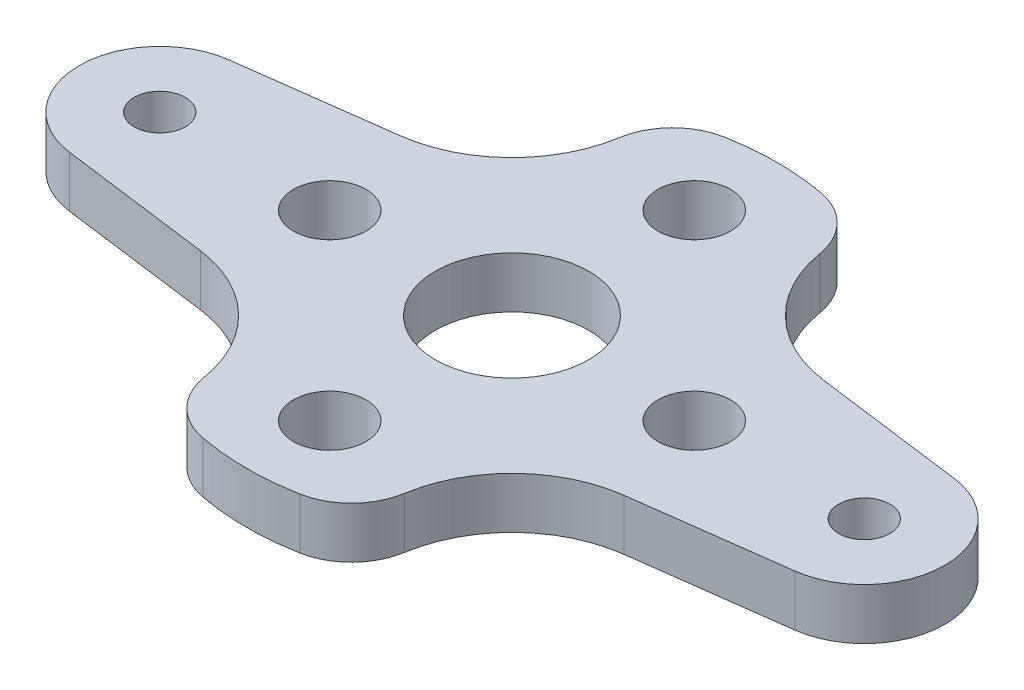
ISO-10303-21;
HEADER;
FILE_DESCRIPTION(('STEP AP214'),'2;1');
FILE_NAME('part.step','',(''),(''),'','','');
FILE_SCHEMA(('AUTOMOTIVE_DESIGN { 1 0 10303 214 1 1 1 1 }'));
ENDSEC;
DATA;
#1=APPLICATION_CONTEXT('core data for automotive mechanical design processes');
#2=APPLICATION_PROTOCOL_DEFINITION('international standard','automotive_design',2000,#1);
#3=PRODUCT_CONTEXT('',#1,'mechanical');
#4=PRODUCT('Part','Part','',(#3));
#5=PRODUCT_RELATED_PRODUCT_CATEGORY('part','',(#4));
#6=PRODUCT_DEFINITION_FORMATION('','',#4);
#7=PRODUCT_DEFINITION_CONTEXT('part definition',#1,'design');
#8=PRODUCT_DEFINITION('design','',#6,#7);
#9=PRODUCT_DEFINITION_SHAPE('','',#8);
#10=(LENGTH_UNIT() NAMED_UNIT(*) SI_UNIT(.MILLI.,.METRE.));
#11=(NAMED_UNIT(*) PLANE_ANGLE_UNIT() SI_UNIT($,.RADIAN.));
#12=(NAMED_UNIT(*) SI_UNIT($,.STERADIAN.) SOLID_ANGLE_UNIT());
#13=UNCERTAINTY_MEASURE_WITH_UNIT(LENGTH_MEASURE(1.E-05),#10,'distance_accuracy_value','');
#14=(GEOMETRIC_REPRESENTATION_CONTEXT(3) GLOBAL_UNCERTAINTY_ASSIGNED_CONTEXT((#13)) GLOBAL_UNIT_ASSIGNED_CONTEXT((#10,
#11,#12)) REPRESENTATION_CONTEXT('',''));
#15=CARTESIAN_POINT('',(0.,0.,0.));
#16=DIRECTION('',(0.,0.,1.));
#17=DIRECTION('',(1.,0.,0.));
#18=AXIS2_PLACEMENT_3D('',#15,#16,#17);
#19=CARTESIAN_POINT('',(0.,0.,-21.8652));
#20=DIRECTION('',(0.,-1.,0.));
#21=DIRECTION('',(0.,0.,-1.));
#22=AXIS2_PLACEMENT_3D('',#19,#20,#21);
#23=PLANE('',#22);
#24=CARTESIAN_POINT('',(21.8652,0.,0.));
#25=DIRECTION('',(0.,1.,0.));
#26=DIRECTION('',(0.,0.,1.));
#27=AXIS2_PLACEMENT_3D('',#24,#25,#26);
#28=CIRCLE('',#27,1.5875);
#29=CARTESIAN_POINT('',(21.8652,0.,1.58750000000007));
#30=VERTEX_POINT('',#29);
#31=EDGE_CURVE('E189',#30,#30,#28,.T.);
#32=ORIENTED_EDGE('',*,*,#31,.T.);
#33=EDGE_LOOP('',(#32));
#34=FACE_BOUND('',#33,.T.);
#35=CARTESIAN_POINT('',(-21.8652,0.,0.));
#36=DIRECTION('',(0.,1.,0.));
#37=DIRECTION('',(0.,0.,1.));
#38=AXIS2_PLACEMENT_3D('',#35,#36,#37);
#39=CIRCLE('',#38,1.5875);
#40=CARTESIAN_POINT('',(-21.8652,0.,1.58749999999994));
#41=VERTEX_POINT('',#40);
#42=EDGE_CURVE('E322',#41,#41,#39,.T.);
#43=ORIENTED_EDGE('',*,*,#42,.T.);
#44=EDGE_LOOP('',(#43));
#45=FACE_BOUND('',#44,.T.);
#46=CARTESIAN_POINT('',(0.,0.,0.));
#47=DIRECTION('',(0.,1.,0.));
#48=DIRECTION('',(0.,0.,1.));
#49=AXIS2_PLACEMENT_3D('',#46,#47,#48);
#50=CIRCLE('',#49,4.7625);
#51=CARTESIAN_POINT('',(0.,0.,4.7625));
#52=VERTEX_POINT('',#51);
#53=EDGE_CURVE('E314',#52,#52,#50,.T.);
#54=ORIENTED_EDGE('',*,*,#53,.T.);
#55=EDGE_LOOP('',(#54));
#56=FACE_BOUND('',#55,.T.);
#57=CARTESIAN_POINT('',(-11.3137084989848,0.,0.));
#58=DIRECTION('',(0.,1.,0.));
#59=DIRECTION('',(0.,0.,1.));
#60=AXIS2_PLACEMENT_3D('',#57,#58,#59);
#61=CIRCLE('',#60,2.25);
#62=CARTESIAN_POINT('',(-11.3137084989848,0.,2.25));
#63=VERTEX_POINT('',#62);
#64=EDGE_CURVE('E310',#63,#63,#61,.T.);
#65=ORIENTED_EDGE('',*,*,#64,.T.);
#66=EDGE_LOOP('',(#65));
#67=FACE_BOUND('',#66,.T.);
#68=CARTESIAN_POINT('',(0.,0.,11.3137084989848));
#69=DIRECTION('',(0.,1.,0.));
#70=DIRECTION('',(0.,0.,1.));
#71=AXIS2_PLACEMENT_3D('',#68,#69,#70);
#72=CIRCLE('',#71,2.25);
#73=CARTESIAN_POINT('',(0.,0.,13.5637084989848));
#74=VERTEX_POINT('',#73);
#75=EDGE_CURVE('E304',#74,#74,#72,.T.);
#76=ORIENTED_EDGE('',*,*,#75,.T.);
#77=EDGE_LOOP('',(#76));
#78=FACE_BOUND('',#77,.T.);
#79=CARTESIAN_POINT('',(11.3137084989848,0.,0.));
#80=DIRECTION('',(0.,1.,0.));
#81=DIRECTION('',(0.,0.,1.));
#82=AXIS2_PLACEMENT_3D('',#79,#80,#81);
#83=CIRCLE('',#82,2.25);
#84=CARTESIAN_POINT('',(11.3137084989848,0.,2.25));
#85=VERTEX_POINT('',#84);
#86=EDGE_CURVE('E298',#85,#85,#83,.T.);
#87=ORIENTED_EDGE('',*,*,#86,.T.);
#88=EDGE_LOOP('',(#87));
#89=FACE_BOUND('',#88,.T.);
#90=CARTESIAN_POINT('',(0.,0.,-11.3137084989848));
#91=DIRECTION('',(0.,1.,0.));
#92=DIRECTION('',(0.,0.,1.));
#93=AXIS2_PLACEMENT_3D('',#90,#91,#92);
#94=CIRCLE('',#93,2.25);
#95=CARTESIAN_POINT('',(0.,0.,-9.06370849898476));
#96=VERTEX_POINT('',#95);
#97=EDGE_CURVE('E291',#96,#96,#94,.T.);
#98=ORIENTED_EDGE('',*,*,#97,.T.);
#99=EDGE_LOOP('',(#98));
#100=FACE_BOUND('',#99,.T.);
#101=CARTESIAN_POINT('',(0.,0.,0.));
#102=DIRECTION('',(0.,1.,0.));
#103=DIRECTION('',(0.,0.,1.));
#104=AXIS2_PLACEMENT_3D('',#101,#102,#103);
#105=CIRCLE('',#104,16.4586109486837);
#106=CARTESIAN_POINT('',(3.01255926254053,0.,-16.1805550291024));
#107=VERTEX_POINT('',#106);
#108=CARTESIAN_POINT('',(-3.01255926254053,0.,-16.1805550291024));
#109=VERTEX_POINT('',#108);
#110=EDGE_CURVE('E292',#107,#109,#105,.T.);
#111=ORIENTED_EDGE('',*,*,#110,.F.);
#112=CARTESIAN_POINT('',(2.28040531056162,0.,-12.2481320367729));
#113=DIRECTION('',(0.,-1.,0.));
#114=DIRECTION('',(0.,0.,-1.));
#115=AXIS2_PLACEMENT_3D('',#112,#113,#114);
#116=CIRCLE('',#115,4.);
#117=CARTESIAN_POINT('',(6.22840750102796,0.,-12.8909996001738));
#118=VERTEX_POINT('',#117);
#119=EDGE_CURVE('E257',#107,#118,#116,.T.);
#120=ORIENTED_EDGE('',*,*,#119,.T.);
#121=CARTESIAN_POINT('',(14.1869118191913,0.,-14.1869118191913));
#122=DIRECTION('',(0.,-1.,0.));
#123=DIRECTION('',(0.,0.,1.));
#124=AXIS2_PLACEMENT_3D('',#121,#122,#123);
#125=CIRCLE('',#124,8.06332310289146);
#126=CARTESIAN_POINT('',(13.1344369579309,0.,-6.19257156323278));
#127=VERTEX_POINT('',#126);
#128=EDGE_CURVE('E203',#127,#118,#125,.T.);
#129=ORIENTED_EDGE('',*,*,#128,.F.);
#130=DIRECTION('',(-0.991444861373811,0.,-0.130526192220049));
#131=VECTOR('',#130,1.);
#132=CARTESIAN_POINT('',(22.5178309611002,0.,-4.95722430686898));
#133=LINE('',#132,#131);
#134=CARTESIAN_POINT('',(22.5178309611002,0.,-4.95722430686898));
#135=VERTEX_POINT('',#134);
#136=EDGE_CURVE('E221',#135,#127,#133,.T.);
#137=ORIENTED_EDGE('',*,*,#136,.F.);
#138=CARTESIAN_POINT('',(21.8652,0.,0.));
#139=DIRECTION('',(0.,1.,0.));
#140=DIRECTION('',(0.,0.,1.));
#141=AXIS2_PLACEMENT_3D('',#138,#139,#140);
#142=CIRCLE('',#141,5.);
#143=CARTESIAN_POINT('',(22.5178309611002,0.,4.95722430686913));
#144=VERTEX_POINT('',#143);
#145=EDGE_CURVE('E219',#144,#135,#142,.T.);
#146=ORIENTED_EDGE('',*,*,#145,.F.);
#147=DIRECTION('',(0.991444861373812,0.,-0.130526192220042));
#148=VECTOR('',#147,1.);
#149=CARTESIAN_POINT('',(22.5178309611002,0.,4.95722430686913));
#150=LINE('',#149,#148);
#151=CARTESIAN_POINT('',(13.1344369579309,0.,6.19257156323287));
#152=VERTEX_POINT('',#151);
#153=EDGE_CURVE('E217',#152,#144,#150,.T.);
#154=ORIENTED_EDGE('',*,*,#153,.F.);
#155=CARTESIAN_POINT('',(14.1869118191912,0.,14.1869118191913));
#156=DIRECTION('',(0.,-1.,0.));
#157=DIRECTION('',(0.,0.,1.));
#158=AXIS2_PLACEMENT_3D('',#155,#156,#157);
#159=CIRCLE('',#158,8.06332310289146);
#160=CARTESIAN_POINT('',(6.22840750102788,0.,12.8909996001739));
#161=VERTEX_POINT('',#160);
#162=EDGE_CURVE('E215',#161,#152,#159,.T.);
#163=ORIENTED_EDGE('',*,*,#162,.F.);
#164=CARTESIAN_POINT('',(2.28040531056154,0.,12.248132036773));
#165=DIRECTION('',(0.,-1.,0.));
#166=DIRECTION('',(0.,0.,-1.));
#167=AXIS2_PLACEMENT_3D('',#164,#165,#166);
#168=CIRCLE('',#167,4.);
#169=CARTESIAN_POINT('',(3.01255926254043,0.,16.1805550291025));
#170=VERTEX_POINT('',#169);
#171=EDGE_CURVE('E252',#161,#170,#168,.T.);
#172=ORIENTED_EDGE('',*,*,#171,.T.);
#173=CARTESIAN_POINT('',(0.,0.,0.));
#174=DIRECTION('',(0.,1.,0.));
#175=DIRECTION('',(0.,0.,1.));
#176=AXIS2_PLACEMENT_3D('',#173,#174,#175);
#177=CIRCLE('',#176,16.4586109486837);
#178=CARTESIAN_POINT('',(-3.01255926254052,0.,16.1805550291024));
#179=VERTEX_POINT('',#178);
#180=EDGE_CURVE('E270',#179,#170,#177,.T.);
#181=ORIENTED_EDGE('',*,*,#180,.F.);
#182=CARTESIAN_POINT('',(-2.28040531056161,0.,12.2481320367729));
#183=DIRECTION('',(0.,-1.,0.));
#184=DIRECTION('',(0.,0.,-1.));
#185=AXIS2_PLACEMENT_3D('',#182,#183,#184);
#186=CIRCLE('',#185,4.);
#187=CARTESIAN_POINT('',(-6.22840750102796,0.,12.8909996001738));
#188=VERTEX_POINT('',#187);
#189=EDGE_CURVE('E62',#179,#188,#186,.T.);
#190=ORIENTED_EDGE('',*,*,#189,.T.);
#191=CARTESIAN_POINT('',(-14.1869118191913,0.,14.1869118191913));
#192=DIRECTION('',(0.,1.,0.));
#193=DIRECTION('',(1.,0.,0.));
#194=AXIS2_PLACEMENT_3D('',#191,#192,#193);
#195=CIRCLE('',#194,8.06332310289146);
#196=CARTESIAN_POINT('',(-13.1344369579309,0.,6.19257156323279));
#197=VERTEX_POINT('',#196);
#198=EDGE_CURVE('E191',#188,#197,#195,.T.);
#199=ORIENTED_EDGE('',*,*,#198,.T.);
#200=DIRECTION('',(-0.991444861373811,0.,-0.130526192220048));
#201=VECTOR('',#200,1.);
#202=CARTESIAN_POINT('',(-22.5178309611002,0.,4.957224306869));
#203=LINE('',#202,#201);
#204=CARTESIAN_POINT('',(-22.5178309611002,0.,4.957224306869));
#205=VERTEX_POINT('',#204);
#206=EDGE_CURVE('E188',#197,#205,#203,.T.);
#207=ORIENTED_EDGE('',*,*,#206,.T.);
#208=CARTESIAN_POINT('',(-21.8652,0.,0.));
#209=DIRECTION('',(0.,-1.,0.));
#210=DIRECTION('',(-1.,0.,0.));
#211=AXIS2_PLACEMENT_3D('',#208,#209,#210);
#212=CIRCLE('',#211,5.);
#213=CARTESIAN_POINT('',(-22.5178309611002,0.,-4.95722430686912));
#214=VERTEX_POINT('',#213);
#215=EDGE_CURVE('E159',#205,#214,#212,.T.);
#216=ORIENTED_EDGE('',*,*,#215,.T.);
#217=DIRECTION('',(0.991444861373812,0.,-0.130526192220042));
#218=VECTOR('',#217,1.);
#219=CARTESIAN_POINT('',(-22.5178309611002,0.,-4.95722430686912));
#220=LINE('',#219,#218);
#221=CARTESIAN_POINT('',(-13.1344369579309,0.,-6.19257156323286));
#222=VERTEX_POINT('',#221);
#223=EDGE_CURVE('E175',#214,#222,#220,.T.);
#224=ORIENTED_EDGE('',*,*,#223,.T.);
#225=CARTESIAN_POINT('',(-14.1869118191913,0.,-14.1869118191913));
#226=DIRECTION('',(0.,-1.,0.));
#227=DIRECTION('',(0.,0.,-1.));
#228=AXIS2_PLACEMENT_3D('',#225,#226,#227);
#229=CIRCLE('',#228,8.06332310289146);
#230=CARTESIAN_POINT('',(-6.22840750102796,0.,-12.8909996001738));
#231=VERTEX_POINT('',#230);
#232=EDGE_CURVE('E164',#231,#222,#229,.T.);
#233=ORIENTED_EDGE('',*,*,#232,.F.);
#234=CARTESIAN_POINT('',(-2.28040531056162,0.,-12.2481320367729));
#235=DIRECTION('',(0.,-1.,0.));
#236=DIRECTION('',(0.,0.,-1.));
#237=AXIS2_PLACEMENT_3D('',#234,#235,#236);
#238=CIRCLE('',#237,4.);
#239=EDGE_CURVE('E255',#231,#109,#238,.T.);
#240=ORIENTED_EDGE('',*,*,#239,.T.);
#241=EDGE_LOOP('',(#111,#120,#129,#137,#146,#154,#163,#172,#181,#190,#199,#207,#216,#224,#233,#240));
#242=FACE_BOUND('',#241,.T.);
#243=ADVANCED_FACE('F39',(#34,#45,#56,#67,#78,#89,#100,#242),#23,.T.);
#244=CARTESIAN_POINT('',(0.,3.175,-21.8652));
#245=DIRECTION('',(0.,-1.,0.));
#246=DIRECTION('',(0.,0.,-1.));
#247=AXIS2_PLACEMENT_3D('',#244,#245,#246);
#248=PLANE('',#247);
#249=CARTESIAN_POINT('',(0.,3.175,-11.3137084989848));
#250=DIRECTION('',(0.,1.,0.));
#251=DIRECTION('',(0.,0.,1.));
#252=AXIS2_PLACEMENT_3D('',#249,#250,#251);
#253=CIRCLE('',#252,2.25);
#254=CARTESIAN_POINT('',(0.,3.175,-9.06370849898476));
#255=VERTEX_POINT('',#254);
#256=EDGE_CURVE('E288',#255,#255,#253,.T.);
#257=ORIENTED_EDGE('',*,*,#256,.F.);
#258=EDGE_LOOP('',(#257));
#259=FACE_BOUND('',#258,.T.);
#260=CARTESIAN_POINT('',(11.3137084989848,3.175,0.));
#261=DIRECTION('',(0.,1.,0.));
#262=DIRECTION('',(0.,0.,1.));
#263=AXIS2_PLACEMENT_3D('',#260,#261,#262);
#264=CIRCLE('',#263,2.25);
#265=CARTESIAN_POINT('',(11.3137084989848,3.175,2.25));
#266=VERTEX_POINT('',#265);
#267=EDGE_CURVE('E295',#266,#266,#264,.T.);
#268=ORIENTED_EDGE('',*,*,#267,.F.);
#269=EDGE_LOOP('',(#268));
#270=FACE_BOUND('',#269,.T.);
#271=CARTESIAN_POINT('',(0.,3.175,11.3137084989848));
#272=DIRECTION('',(0.,1.,0.));
#273=DIRECTION('',(0.,0.,1.));
#274=AXIS2_PLACEMENT_3D('',#271,#272,#273);
#275=CIRCLE('',#274,2.25);
#276=CARTESIAN_POINT('',(0.,3.175,13.5637084989848));
#277=VERTEX_POINT('',#276);
#278=EDGE_CURVE('E301',#277,#277,#275,.T.);
#279=ORIENTED_EDGE('',*,*,#278,.F.);
#280=EDGE_LOOP('',(#279));
#281=FACE_BOUND('',#280,.T.);
#282=CARTESIAN_POINT('',(-11.3137084989848,3.175,0.));
#283=DIRECTION('',(0.,1.,0.));
#284=DIRECTION('',(0.,0.,1.));
#285=AXIS2_PLACEMENT_3D('',#282,#283,#284);
#286=CIRCLE('',#285,2.25);
#287=CARTESIAN_POINT('',(-11.3137084989848,3.175,2.25));
#288=VERTEX_POINT('',#287);
#289=EDGE_CURVE('E307',#288,#288,#286,.T.);
#290=ORIENTED_EDGE('',*,*,#289,.F.);
#291=EDGE_LOOP('',(#290));
#292=FACE_BOUND('',#291,.T.);
#293=CARTESIAN_POINT('',(0.,3.175,0.));
#294=DIRECTION('',(0.,1.,0.));
#295=DIRECTION('',(0.,0.,1.));
#296=AXIS2_PLACEMENT_3D('',#293,#294,#295);
#297=CIRCLE('',#296,4.7625);
#298=CARTESIAN_POINT('',(0.,3.175,4.7625));
#299=VERTEX_POINT('',#298);
#300=EDGE_CURVE('E313',#299,#299,#297,.T.);
#301=ORIENTED_EDGE('',*,*,#300,.F.);
#302=EDGE_LOOP('',(#301));
#303=FACE_BOUND('',#302,.T.);
#304=CARTESIAN_POINT('',(-21.8652,3.175,0.));
#305=DIRECTION('',(0.,1.,0.));
#306=DIRECTION('',(0.,0.,1.));
#307=AXIS2_PLACEMENT_3D('',#304,#305,#306);
#308=CIRCLE('',#307,1.5875);
#309=CARTESIAN_POINT('',(-21.8652,3.175,1.58749999999994));
#310=VERTEX_POINT('',#309);
#311=EDGE_CURVE('E317',#310,#310,#308,.T.);
#312=ORIENTED_EDGE('',*,*,#311,.F.);
#313=EDGE_LOOP('',(#312));
#314=FACE_BOUND('',#313,.T.);
#315=CARTESIAN_POINT('',(21.8652,3.175,0.));
#316=DIRECTION('',(0.,1.,0.));
#317=DIRECTION('',(0.,0.,1.));
#318=AXIS2_PLACEMENT_3D('',#315,#316,#317);
#319=CIRCLE('',#318,1.5875);
#320=CARTESIAN_POINT('',(21.8652,3.175,1.58750000000007));
#321=VERTEX_POINT('',#320);
#322=EDGE_CURVE('E325',#321,#321,#319,.T.);
#323=ORIENTED_EDGE('',*,*,#322,.F.);
#324=EDGE_LOOP('',(#323));
#325=FACE_BOUND('',#324,.T.);
#326=CARTESIAN_POINT('',(14.1869118191913,3.175,-14.1869118191913));
#327=DIRECTION('',(0.,-1.,0.));
#328=DIRECTION('',(0.,0.,1.));
#329=AXIS2_PLACEMENT_3D('',#326,#327,#328);
#330=CIRCLE('',#329,8.06332310289146);
#331=CARTESIAN_POINT('',(13.1344369579309,3.175,-6.19257156323278));
#332=VERTEX_POINT('',#331);
#333=CARTESIAN_POINT('',(6.22840750102796,3.175,-12.8909996001738));
#334=VERTEX_POINT('',#333);
#335=EDGE_CURVE('E211',#332,#334,#330,.T.);
#336=ORIENTED_EDGE('',*,*,#335,.T.);
#337=CARTESIAN_POINT('',(2.28040531056162,3.175,-12.2481320367729));
#338=DIRECTION('',(0.,-1.,0.));
#339=DIRECTION('',(0.,0.,-1.));
#340=AXIS2_PLACEMENT_3D('',#337,#338,#339);
#341=CIRCLE('',#340,4.);
#342=CARTESIAN_POINT('',(3.01255926254053,3.175,-16.1805550291024));
#343=VERTEX_POINT('',#342);
#344=EDGE_CURVE('E245',#334,#343,#341,.F.);
#345=ORIENTED_EDGE('',*,*,#344,.T.);
#346=CARTESIAN_POINT('',(0.,3.175,0.));
#347=DIRECTION('',(0.,1.,0.));
#348=DIRECTION('',(0.,0.,1.));
#349=AXIS2_PLACEMENT_3D('',#346,#347,#348);
#350=CIRCLE('',#349,16.4586109486837);
#351=CARTESIAN_POINT('',(-3.01255926254053,3.175,-16.1805550291024));
#352=VERTEX_POINT('',#351);
#353=EDGE_CURVE('E278',#343,#352,#350,.T.);
#354=ORIENTED_EDGE('',*,*,#353,.T.);
#355=CARTESIAN_POINT('',(-2.28040531056162,3.175,-12.2481320367729));
#356=DIRECTION('',(0.,-1.,0.));
#357=DIRECTION('',(0.,0.,-1.));
#358=AXIS2_PLACEMENT_3D('',#355,#356,#357);
#359=CIRCLE('',#358,4.);
#360=CARTESIAN_POINT('',(-6.22840750102796,3.175,-12.8909996001738));
#361=VERTEX_POINT('',#360);
#362=EDGE_CURVE('E243',#352,#361,#359,.F.);
#363=ORIENTED_EDGE('',*,*,#362,.T.);
#364=CARTESIAN_POINT('',(-14.1869118191913,3.175,-14.1869118191913));
#365=DIRECTION('',(0.,-1.,0.));
#366=DIRECTION('',(0.,0.,-1.));
#367=AXIS2_PLACEMENT_3D('',#364,#365,#366);
#368=CIRCLE('',#367,8.06332310289146);
#369=CARTESIAN_POINT('',(-13.1344369579309,3.175,-6.19257156323286));
#370=VERTEX_POINT('',#369);
#371=EDGE_CURVE('E200',#361,#370,#368,.T.);
#372=ORIENTED_EDGE('',*,*,#371,.T.);
#373=DIRECTION('',(0.991444861373812,0.,-0.130526192220042));
#374=VECTOR('',#373,1.);
#375=CARTESIAN_POINT('',(-22.5178309611002,3.175,-4.95722430686912));
#376=LINE('',#375,#374);
#377=CARTESIAN_POINT('',(-22.5178309611002,3.175,-4.95722430686912));
#378=VERTEX_POINT('',#377);
#379=EDGE_CURVE('E174',#378,#370,#376,.T.);
#380=ORIENTED_EDGE('',*,*,#379,.F.);
#381=CARTESIAN_POINT('',(-21.8652,3.175,0.));
#382=DIRECTION('',(0.,-1.,0.));
#383=DIRECTION('',(-1.,0.,0.));
#384=AXIS2_PLACEMENT_3D('',#381,#382,#383);
#385=CIRCLE('',#384,5.);
#386=CARTESIAN_POINT('',(-22.5178309611002,3.175,4.957224306869));
#387=VERTEX_POINT('',#386);
#388=EDGE_CURVE('E156',#387,#378,#385,.T.);
#389=ORIENTED_EDGE('',*,*,#388,.F.);
#390=DIRECTION('',(-0.991444861373811,0.,-0.130526192220048));
#391=VECTOR('',#390,1.);
#392=CARTESIAN_POINT('',(-22.5178309611002,3.175,4.957224306869));
#393=LINE('',#392,#391);
#394=CARTESIAN_POINT('',(-13.1344369579309,3.175,6.19257156323279));
#395=VERTEX_POINT('',#394);
#396=EDGE_CURVE('E172',#395,#387,#393,.T.);
#397=ORIENTED_EDGE('',*,*,#396,.F.);
#398=CARTESIAN_POINT('',(-14.1869118191913,3.175,14.1869118191913));
#399=DIRECTION('',(0.,1.,0.));
#400=DIRECTION('',(1.,0.,0.));
#401=AXIS2_PLACEMENT_3D('',#398,#399,#400);
#402=CIRCLE('',#401,8.06332310289146);
#403=CARTESIAN_POINT('',(-6.22840750102796,3.175,12.8909996001738));
#404=VERTEX_POINT('',#403);
#405=EDGE_CURVE('E180',#404,#395,#402,.T.);
#406=ORIENTED_EDGE('',*,*,#405,.F.);
#407=CARTESIAN_POINT('',(-2.28040531056161,3.175,12.2481320367729));
#408=DIRECTION('',(0.,-1.,0.));
#409=DIRECTION('',(0.,0.,-1.));
#410=AXIS2_PLACEMENT_3D('',#407,#408,#409);
#411=CIRCLE('',#410,4.);
#412=CARTESIAN_POINT('',(-3.01255926254052,3.175,16.1805550291024));
#413=VERTEX_POINT('',#412);
#414=EDGE_CURVE('E241',#404,#413,#411,.F.);
#415=ORIENTED_EDGE('',*,*,#414,.T.);
#416=CARTESIAN_POINT('',(0.,3.175,0.));
#417=DIRECTION('',(0.,1.,0.));
#418=DIRECTION('',(0.,0.,1.));
#419=AXIS2_PLACEMENT_3D('',#416,#417,#418);
#420=CIRCLE('',#419,16.4586109486837);
#421=CARTESIAN_POINT('',(3.01255926254043,3.175,16.1805550291025));
#422=VERTEX_POINT('',#421);
#423=EDGE_CURVE('E273',#413,#422,#420,.T.);
#424=ORIENTED_EDGE('',*,*,#423,.T.);
#425=CARTESIAN_POINT('',(2.28040531056154,3.175,12.248132036773));
#426=DIRECTION('',(0.,-1.,0.));
#427=DIRECTION('',(0.,0.,-1.));
#428=AXIS2_PLACEMENT_3D('',#425,#426,#427);
#429=CIRCLE('',#428,4.);
#430=CARTESIAN_POINT('',(6.22840750102788,3.175,12.8909996001739));
#431=VERTEX_POINT('',#430);
#432=EDGE_CURVE('E239',#422,#431,#429,.F.);
#433=ORIENTED_EDGE('',*,*,#432,.T.);
#434=CARTESIAN_POINT('',(14.1869118191912,3.175,14.1869118191913));
#435=DIRECTION('',(0.,-1.,0.));
#436=DIRECTION('',(0.,0.,1.));
#437=AXIS2_PLACEMENT_3D('',#434,#435,#436);
#438=CIRCLE('',#437,8.06332310289146);
#439=CARTESIAN_POINT('',(13.1344369579309,3.175,6.19257156323287));
#440=VERTEX_POINT('',#439);
#441=EDGE_CURVE('E202',#431,#440,#438,.T.);
#442=ORIENTED_EDGE('',*,*,#441,.T.);
#443=DIRECTION('',(0.991444861373812,0.,-0.130526192220042));
#444=VECTOR('',#443,1.);
#445=CARTESIAN_POINT('',(22.5178309611002,3.175,4.95722430686913));
#446=LINE('',#445,#444);
#447=CARTESIAN_POINT('',(22.5178309611002,3.175,4.95722430686913));
#448=VERTEX_POINT('',#447);
#449=EDGE_CURVE('E205',#440,#448,#446,.T.);
#450=ORIENTED_EDGE('',*,*,#449,.T.);
#451=CARTESIAN_POINT('',(21.8652,3.175,0.));
#452=DIRECTION('',(0.,1.,0.));
#453=DIRECTION('',(0.,0.,1.));
#454=AXIS2_PLACEMENT_3D('',#451,#452,#453);
#455=CIRCLE('',#454,5.);
#456=CARTESIAN_POINT('',(22.5178309611002,3.175,-4.95722430686898));
#457=VERTEX_POINT('',#456);
#458=EDGE_CURVE('E207',#448,#457,#455,.T.);
#459=ORIENTED_EDGE('',*,*,#458,.T.);
#460=DIRECTION('',(-0.991444861373811,0.,-0.130526192220049));
#461=VECTOR('',#460,1.);
#462=CARTESIAN_POINT('',(22.5178309611002,3.175,-4.95722430686898));
#463=LINE('',#462,#461);
#464=EDGE_CURVE('E209',#457,#332,#463,.T.);
#465=ORIENTED_EDGE('',*,*,#464,.T.);
#466=EDGE_LOOP('',(#336,#345,#354,#363,#372,#380,#389,#397,#406,#415,#424,#433,#442,#450,#459,#465));
#467=FACE_BOUND('',#466,.T.);
#468=ADVANCED_FACE('F170',(#259,#270,#281,#292,#303,#314,#325,#467),#248,.F.);
#469=CARTESIAN_POINT('',(-14.1869118191913,3.175,-14.1869118191913));
#470=DIRECTION('',(0.,-1.,0.));
#471=DIRECTION('',(0.,0.,-1.));
#472=AXIS2_PLACEMENT_3D('',#469,#470,#471);
#473=CYLINDRICAL_SURFACE('',#472,8.06332310289146);
#474=ORIENTED_EDGE('',*,*,#371,.F.);
#475=DIRECTION('',(0.,-1.,0.));
#476=VECTOR('',#475,1.);
#477=CARTESIAN_POINT('',(-6.22840750102796,3.175,-12.8909996001738));
#478=LINE('',#477,#476);
#479=EDGE_CURVE('E54',#361,#231,#478,.T.);
#480=ORIENTED_EDGE('',*,*,#479,.T.);
#481=ORIENTED_EDGE('',*,*,#232,.T.);
#482=DIRECTION('',(0.,-1.,0.));
#483=VECTOR('',#482,1.);
#484=CARTESIAN_POINT('',(-13.1344369579309,3.175,-6.19257156323286));
#485=LINE('',#484,#483);
#486=EDGE_CURVE('E196',#370,#222,#485,.T.);
#487=ORIENTED_EDGE('',*,*,#486,.F.);
#488=EDGE_LOOP('',(#474,#480,#481,#487));
#489=FACE_BOUND('',#488,.T.);
#490=ADVANCED_FACE('F341',(#489),#473,.F.);
#491=CARTESIAN_POINT('',(14.1869118191912,3.175,14.1869118191913));
#492=DIRECTION('',(0.,-1.,0.));
#493=DIRECTION('',(0.,0.,-1.));
#494=AXIS2_PLACEMENT_3D('',#491,#492,#493);
#495=CYLINDRICAL_SURFACE('',#494,8.06332310289146);
#496=ORIENTED_EDGE('',*,*,#441,.F.);
#497=DIRECTION('',(0.,-1.,0.));
#498=VECTOR('',#497,1.);
#499=CARTESIAN_POINT('',(6.22840750102788,3.175,12.8909996001739));
#500=LINE('',#499,#498);
#501=EDGE_CURVE('E11',#431,#161,#500,.T.);
#502=ORIENTED_EDGE('',*,*,#501,.T.);
#503=ORIENTED_EDGE('',*,*,#162,.T.);
#504=DIRECTION('',(0.,-1.,0.));
#505=VECTOR('',#504,1.);
#506=CARTESIAN_POINT('',(13.1344369579309,3.175,6.19257156323287));
#507=LINE('',#506,#505);
#508=EDGE_CURVE('E233',#440,#152,#507,.T.);
#509=ORIENTED_EDGE('',*,*,#508,.F.);
#510=EDGE_LOOP('',(#496,#502,#503,#509));
#511=FACE_BOUND('',#510,.T.);
#512=ADVANCED_FACE('F348',(#511),#495,.F.);
#513=CARTESIAN_POINT('',(22.5178309611002,3.175,4.95722430686913));
#514=DIRECTION('',(-0.130526192220042,0.,-0.991444861373812));
#515=DIRECTION('',(-0.991444861373812,0.,0.130526192220042));
#516=AXIS2_PLACEMENT_3D('',#513,#514,#515);
#517=PLANE('',#516);
#518=ORIENTED_EDGE('',*,*,#153,.T.);
#519=DIRECTION('',(0.,-1.,0.));
#520=VECTOR('',#519,1.);
#521=CARTESIAN_POINT('',(22.5178309611002,3.175,4.95722430686913));
#522=LINE('',#521,#520);
#523=EDGE_CURVE('E230',#448,#144,#522,.T.);
#524=ORIENTED_EDGE('',*,*,#523,.F.);
#525=ORIENTED_EDGE('',*,*,#449,.F.);
#526=ORIENTED_EDGE('',*,*,#508,.T.);
#527=EDGE_LOOP('',(#518,#524,#525,#526));
#528=FACE_BOUND('',#527,.T.);
#529=ADVANCED_FACE('F367',(#528),#517,.F.);
#530=CARTESIAN_POINT('',(21.8652,3.175,0.));
#531=DIRECTION('',(0.,-1.,0.));
#532=DIRECTION('',(0.,0.,-1.));
#533=AXIS2_PLACEMENT_3D('',#530,#531,#532);
#534=CYLINDRICAL_SURFACE('',#533,5.);
#535=ORIENTED_EDGE('',*,*,#145,.T.);
#536=DIRECTION('',(0.,-1.,0.));
#537=VECTOR('',#536,1.);
#538=CARTESIAN_POINT('',(22.5178309611002,3.175,-4.95722430686898));
#539=LINE('',#538,#537);
#540=EDGE_CURVE('E227',#457,#135,#539,.T.);
#541=ORIENTED_EDGE('',*,*,#540,.F.);
#542=ORIENTED_EDGE('',*,*,#458,.F.);
#543=ORIENTED_EDGE('',*,*,#523,.T.);
#544=EDGE_LOOP('',(#535,#541,#542,#543));
#545=FACE_BOUND('',#544,.T.);
#546=ADVANCED_FACE('F363',(#545),#534,.T.);
#547=CARTESIAN_POINT('',(22.5178309611002,3.175,-4.95722430686898));
#548=DIRECTION('',(-0.130526192220049,0.,0.991444861373811));
#549=DIRECTION('',(0.991444861373811,0.,0.130526192220049));
#550=AXIS2_PLACEMENT_3D('',#547,#548,#549);
#551=PLANE('',#550);
#552=ORIENTED_EDGE('',*,*,#136,.T.);
#553=DIRECTION('',(0.,-1.,0.));
#554=VECTOR('',#553,1.);
#555=CARTESIAN_POINT('',(13.1344369579309,3.175,-6.19257156323278));
#556=LINE('',#555,#554);
#557=EDGE_CURVE('E213',#332,#127,#556,.T.);
#558=ORIENTED_EDGE('',*,*,#557,.F.);
#559=ORIENTED_EDGE('',*,*,#464,.F.);
#560=ORIENTED_EDGE('',*,*,#540,.T.);
#561=EDGE_LOOP('',(#552,#558,#559,#560));
#562=FACE_BOUND('',#561,.T.);
#563=ADVANCED_FACE('F359',(#562),#551,.F.);
#564=CARTESIAN_POINT('',(14.1869118191913,3.175,-14.1869118191913));
#565=DIRECTION('',(0.,-1.,0.));
#566=DIRECTION('',(0.,0.,-1.));
#567=AXIS2_PLACEMENT_3D('',#564,#565,#566);
#568=CYLINDRICAL_SURFACE('',#567,8.06332310289146);
#569=ORIENTED_EDGE('',*,*,#128,.T.);
#570=DIRECTION('',(0.,-1.,0.));
#571=VECTOR('',#570,1.);
#572=CARTESIAN_POINT('',(6.22840750102796,3.175,-12.8909996001738));
#573=LINE('',#572,#571);
#574=EDGE_CURVE('E236',#118,#334,#573,.F.);
#575=ORIENTED_EDGE('',*,*,#574,.T.);
#576=ORIENTED_EDGE('',*,*,#335,.F.);
#577=ORIENTED_EDGE('',*,*,#557,.T.);
#578=EDGE_LOOP('',(#569,#575,#576,#577));
#579=FACE_BOUND('',#578,.T.);
#580=ADVANCED_FACE('F356',(#579),#568,.F.);
#581=CARTESIAN_POINT('',(-21.8652,3.175,0.));
#582=DIRECTION('',(0.,-1.,0.));
#583=DIRECTION('',(0.,0.,-1.));
#584=AXIS2_PLACEMENT_3D('',#581,#582,#583);
#585=CYLINDRICAL_SURFACE('',#584,5.);
#586=ORIENTED_EDGE('',*,*,#215,.F.);
#587=DIRECTION('',(0.,-1.,0.));
#588=VECTOR('',#587,1.);
#589=CARTESIAN_POINT('',(-22.5178309611002,3.175,4.957224306869));
#590=LINE('',#589,#588);
#591=EDGE_CURVE('E153',#387,#205,#590,.T.);
#592=ORIENTED_EDGE('',*,*,#591,.F.);
#593=ORIENTED_EDGE('',*,*,#388,.T.);
#594=DIRECTION('',(0.,-1.,0.));
#595=VECTOR('',#594,1.);
#596=CARTESIAN_POINT('',(-22.5178309611002,3.175,-4.95722430686912));
#597=LINE('',#596,#595);
#598=EDGE_CURVE('E186',#378,#214,#597,.T.);
#599=ORIENTED_EDGE('',*,*,#598,.T.);
#600=EDGE_LOOP('',(#586,#592,#593,#599));
#601=FACE_BOUND('',#600,.T.);
#602=ADVANCED_FACE('F155',(#601),#585,.T.);
#603=CARTESIAN_POINT('',(-22.5178309611002,3.175,4.957224306869));
#604=DIRECTION('',(-0.130526192220048,0.,0.991444861373811));
#605=DIRECTION('',(0.991444861373811,0.,0.130526192220048));
#606=AXIS2_PLACEMENT_3D('',#603,#604,#605);
#607=PLANE('',#606);
#608=ORIENTED_EDGE('',*,*,#206,.F.);
#609=DIRECTION('',(0.,-1.,0.));
#610=VECTOR('',#609,1.);
#611=CARTESIAN_POINT('',(-13.1344369579309,3.175,6.19257156323279));
#612=LINE('',#611,#610);
#613=EDGE_CURVE('E165',#395,#197,#612,.T.);
#614=ORIENTED_EDGE('',*,*,#613,.F.);
#615=ORIENTED_EDGE('',*,*,#396,.T.);
#616=ORIENTED_EDGE('',*,*,#591,.T.);
#617=EDGE_LOOP('',(#608,#614,#615,#616));
#618=FACE_BOUND('',#617,.T.);
#619=ADVANCED_FACE('F178',(#618),#607,.T.);
#620=CARTESIAN_POINT('',(-14.1869118191913,3.175,14.1869118191913));
#621=DIRECTION('',(0.,-1.,0.));
#622=DIRECTION('',(0.,0.,-1.));
#623=AXIS2_PLACEMENT_3D('',#620,#621,#622);
#624=CYLINDRICAL_SURFACE('',#623,8.06332310289146);
#625=ORIENTED_EDGE('',*,*,#198,.F.);
#626=DIRECTION('',(0.,-1.,0.));
#627=VECTOR('',#626,1.);
#628=CARTESIAN_POINT('',(-6.22840750102796,3.175,12.8909996001738));
#629=LINE('',#628,#627);
#630=EDGE_CURVE('E260',#188,#404,#629,.F.);
#631=ORIENTED_EDGE('',*,*,#630,.T.);
#632=ORIENTED_EDGE('',*,*,#405,.T.);
#633=ORIENTED_EDGE('',*,*,#613,.T.);
#634=EDGE_LOOP('',(#625,#631,#632,#633));
#635=FACE_BOUND('',#634,.T.);
#636=ADVANCED_FACE('F283',(#635),#624,.F.);
#637=CARTESIAN_POINT('',(-22.5178309611002,3.175,-4.95722430686912));
#638=DIRECTION('',(-0.130526192220042,0.,-0.991444861373812));
#639=DIRECTION('',(-0.991444861373812,0.,0.130526192220042));
#640=AXIS2_PLACEMENT_3D('',#637,#638,#639);
#641=PLANE('',#640);
#642=ORIENTED_EDGE('',*,*,#223,.F.);
#643=ORIENTED_EDGE('',*,*,#598,.F.);
#644=ORIENTED_EDGE('',*,*,#379,.T.);
#645=ORIENTED_EDGE('',*,*,#486,.T.);
#646=EDGE_LOOP('',(#642,#643,#644,#645));
#647=FACE_BOUND('',#646,.T.);
#648=ADVANCED_FACE('F336',(#647),#641,.T.);
#649=CARTESIAN_POINT('',(21.8652,3.175,0.));
#650=DIRECTION('',(0.,1.,0.));
#651=DIRECTION('',(0.,0.,1.));
#652=AXIS2_PLACEMENT_3D('',#649,#650,#651);
#653=CYLINDRICAL_SURFACE('',#652,1.5875);
#654=ORIENTED_EDGE('',*,*,#31,.F.);
#655=EDGE_LOOP('',(#654));
#656=FACE_BOUND('',#655,.T.);
#657=ORIENTED_EDGE('',*,*,#322,.T.);
#658=EDGE_LOOP('',(#657));
#659=FACE_BOUND('',#658,.T.);
#660=ADVANCED_FACE('F332',(#656,#659),#653,.F.);
#661=CARTESIAN_POINT('',(-21.8652,3.175,0.));
#662=DIRECTION('',(0.,1.,0.));
#663=DIRECTION('',(0.,0.,1.));
#664=AXIS2_PLACEMENT_3D('',#661,#662,#663);
#665=CYLINDRICAL_SURFACE('',#664,1.5875);
#666=ORIENTED_EDGE('',*,*,#42,.F.);
#667=EDGE_LOOP('',(#666));
#668=FACE_BOUND('',#667,.T.);
#669=ORIENTED_EDGE('',*,*,#311,.T.);
#670=EDGE_LOOP('',(#669));
#671=FACE_BOUND('',#670,.T.);
#672=ADVANCED_FACE('F335',(#668,#671),#665,.F.);
#673=CARTESIAN_POINT('',(0.,0.,0.));
#674=DIRECTION('',(0.,1.,0.));
#675=DIRECTION('',(0.,0.,1.));
#676=AXIS2_PLACEMENT_3D('',#673,#674,#675);
#677=CYLINDRICAL_SURFACE('',#676,4.7625);
#678=ORIENTED_EDGE('',*,*,#53,.F.);
#679=EDGE_LOOP('',(#678));
#680=FACE_BOUND('',#679,.T.);
#681=ORIENTED_EDGE('',*,*,#300,.T.);
#682=EDGE_LOOP('',(#681));
#683=FACE_BOUND('',#682,.T.);
#684=ADVANCED_FACE('F513',(#680,#683),#677,.F.);
#685=CARTESIAN_POINT('',(-11.3137084989848,3.175,0.));
#686=DIRECTION('',(0.,1.,0.));
#687=DIRECTION('',(0.,0.,1.));
#688=AXIS2_PLACEMENT_3D('',#685,#686,#687);
#689=CYLINDRICAL_SURFACE('',#688,2.25);
#690=ORIENTED_EDGE('',*,*,#64,.F.);
#691=EDGE_LOOP('',(#690));
#692=FACE_BOUND('',#691,.T.);
#693=ORIENTED_EDGE('',*,*,#289,.T.);
#694=EDGE_LOOP('',(#693));
#695=FACE_BOUND('',#694,.T.);
#696=ADVANCED_FACE('F502',(#692,#695),#689,.F.);
#697=CARTESIAN_POINT('',(0.,3.175,11.3137084989848));
#698=DIRECTION('',(0.,1.,0.));
#699=DIRECTION('',(0.,0.,1.));
#700=AXIS2_PLACEMENT_3D('',#697,#698,#699);
#701=CYLINDRICAL_SURFACE('',#700,2.25);
#702=ORIENTED_EDGE('',*,*,#75,.F.);
#703=EDGE_LOOP('',(#702));
#704=FACE_BOUND('',#703,.T.);
#705=ORIENTED_EDGE('',*,*,#278,.T.);
#706=EDGE_LOOP('',(#705));
#707=FACE_BOUND('',#706,.T.);
#708=ADVANCED_FACE('F491',(#704,#707),#701,.F.);
#709=CARTESIAN_POINT('',(11.3137084989848,3.175,0.));
#710=DIRECTION('',(0.,1.,0.));
#711=DIRECTION('',(0.,0.,1.));
#712=AXIS2_PLACEMENT_3D('',#709,#710,#711);
#713=CYLINDRICAL_SURFACE('',#712,2.25);
#714=ORIENTED_EDGE('',*,*,#86,.F.);
#715=EDGE_LOOP('',(#714));
#716=FACE_BOUND('',#715,.T.);
#717=ORIENTED_EDGE('',*,*,#267,.T.);
#718=EDGE_LOOP('',(#717));
#719=FACE_BOUND('',#718,.T.);
#720=ADVANCED_FACE('F479',(#716,#719),#713,.F.);
#721=CARTESIAN_POINT('',(0.,3.175,-11.3137084989848));
#722=DIRECTION('',(0.,1.,0.));
#723=DIRECTION('',(0.,0.,1.));
#724=AXIS2_PLACEMENT_3D('',#721,#722,#723);
#725=CYLINDRICAL_SURFACE('',#724,2.25);
#726=ORIENTED_EDGE('',*,*,#97,.F.);
#727=EDGE_LOOP('',(#726));
#728=FACE_BOUND('',#727,.T.);
#729=ORIENTED_EDGE('',*,*,#256,.T.);
#730=EDGE_LOOP('',(#729));
#731=FACE_BOUND('',#730,.T.);
#732=ADVANCED_FACE('F474',(#728,#731),#725,.F.);
#733=CARTESIAN_POINT('',(0.,0.,0.));
#734=DIRECTION('',(0.,1.,0.));
#735=DIRECTION('',(0.,0.,1.));
#736=AXIS2_PLACEMENT_3D('',#733,#734,#735);
#737=CYLINDRICAL_SURFACE('',#736,16.4586109486837);
#738=ORIENTED_EDGE('',*,*,#423,.F.);
#739=DIRECTION('',(0.,1.,0.));
#740=VECTOR('',#739,1.);
#741=CARTESIAN_POINT('',(-3.01255926254052,0.,16.1805550291024));
#742=LINE('',#741,#740);
#743=EDGE_CURVE('E47',#413,#179,#742,.F.);
#744=ORIENTED_EDGE('',*,*,#743,.T.);
#745=ORIENTED_EDGE('',*,*,#180,.T.);
#746=DIRECTION('',(0.,1.,0.));
#747=VECTOR('',#746,1.);
#748=CARTESIAN_POINT('',(3.01255926254043,0.,16.1805550291025));
#749=LINE('',#748,#747);
#750=EDGE_CURVE('E263',#170,#422,#749,.T.);
#751=ORIENTED_EDGE('',*,*,#750,.T.);
#752=EDGE_LOOP('',(#738,#744,#745,#751));
#753=FACE_BOUND('',#752,.T.);
#754=ADVANCED_FACE('F269',(#753),#737,.T.);
#755=CARTESIAN_POINT('',(0.,0.,0.));
#756=DIRECTION('',(0.,1.,0.));
#757=DIRECTION('',(0.,0.,1.));
#758=AXIS2_PLACEMENT_3D('',#755,#756,#757);
#759=CYLINDRICAL_SURFACE('',#758,16.4586109486837);
#760=ORIENTED_EDGE('',*,*,#353,.F.);
#761=DIRECTION('',(0.,1.,0.));
#762=VECTOR('',#761,1.);
#763=CARTESIAN_POINT('',(3.01255926254053,0.,-16.1805550291024));
#764=LINE('',#763,#762);
#765=EDGE_CURVE('E250',#343,#107,#764,.F.);
#766=ORIENTED_EDGE('',*,*,#765,.T.);
#767=ORIENTED_EDGE('',*,*,#110,.T.);
#768=DIRECTION('',(0.,1.,0.));
#769=VECTOR('',#768,1.);
#770=CARTESIAN_POINT('',(-3.01255926254053,0.,-16.1805550291024));
#771=LINE('',#770,#769);
#772=EDGE_CURVE('E247',#109,#352,#771,.T.);
#773=ORIENTED_EDGE('',*,*,#772,.T.);
#774=EDGE_LOOP('',(#760,#766,#767,#773));
#775=FACE_BOUND('',#774,.T.);
#776=ADVANCED_FACE('F379',(#775),#759,.T.);
#777=CARTESIAN_POINT('',(2.28040531056162,0.,-12.2481320367729));
#778=DIRECTION('',(0.,-1.,0.));
#779=DIRECTION('',(0.,0.,-1.));
#780=AXIS2_PLACEMENT_3D('',#777,#778,#779);
#781=CYLINDRICAL_SURFACE('',#780,4.);
#782=ORIENTED_EDGE('',*,*,#119,.F.);
#783=ORIENTED_EDGE('',*,*,#765,.F.);
#784=ORIENTED_EDGE('',*,*,#344,.F.);
#785=ORIENTED_EDGE('',*,*,#574,.F.);
#786=EDGE_LOOP('',(#782,#783,#784,#785));
#787=FACE_BOUND('',#786,.T.);
#788=ADVANCED_FACE('F375',(#787),#781,.T.);
#789=CARTESIAN_POINT('',(-2.28040531056162,3.175,-12.2481320367729));
#790=DIRECTION('',(0.,-1.,0.));
#791=DIRECTION('',(0.,0.,-1.));
#792=AXIS2_PLACEMENT_3D('',#789,#790,#791);
#793=CYLINDRICAL_SURFACE('',#792,4.);
#794=ORIENTED_EDGE('',*,*,#239,.F.);
#795=ORIENTED_EDGE('',*,*,#479,.F.);
#796=ORIENTED_EDGE('',*,*,#362,.F.);
#797=ORIENTED_EDGE('',*,*,#772,.F.);
#798=EDGE_LOOP('',(#794,#795,#796,#797));
#799=FACE_BOUND('',#798,.T.);
#800=ADVANCED_FACE('F378',(#799),#793,.T.);
#801=CARTESIAN_POINT('',(-2.28040531056161,0.,12.2481320367729));
#802=DIRECTION('',(0.,-1.,0.));
#803=DIRECTION('',(0.,0.,-1.));
#804=AXIS2_PLACEMENT_3D('',#801,#802,#803);
#805=CYLINDRICAL_SURFACE('',#804,4.);
#806=ORIENTED_EDGE('',*,*,#189,.F.);
#807=ORIENTED_EDGE('',*,*,#743,.F.);
#808=ORIENTED_EDGE('',*,*,#414,.F.);
#809=ORIENTED_EDGE('',*,*,#630,.F.);
#810=EDGE_LOOP('',(#806,#807,#808,#809));
#811=FACE_BOUND('',#810,.T.);
#812=ADVANCED_FACE('F281',(#811),#805,.T.);
#813=CARTESIAN_POINT('',(2.28040531056154,3.175,12.248132036773));
#814=DIRECTION('',(0.,-1.,0.));
#815=DIRECTION('',(0.,0.,-1.));
#816=AXIS2_PLACEMENT_3D('',#813,#814,#815);
#817=CYLINDRICAL_SURFACE('',#816,4.);
#818=ORIENTED_EDGE('',*,*,#171,.F.);
#819=ORIENTED_EDGE('',*,*,#501,.F.);
#820=ORIENTED_EDGE('',*,*,#432,.F.);
#821=ORIENTED_EDGE('',*,*,#750,.F.);
#822=EDGE_LOOP('',(#818,#819,#820,#821));
#823=FACE_BOUND('',#822,.T.);
#824=ADVANCED_FACE('F41',(#823),#817,.T.);
#825=CLOSED_SHELL('',(#243,#468,#490,#512,#529,#546,#563,#580,#602,#619,#636,#648,#660,#672,
#684,#696,#708,#720,#732,#754,#776,#788,#800,#812,#824));
#826=MANIFOLD_SOLID_BREP('B2',#825);
#827=ADVANCED_BREP_SHAPE_REPRESENTATION('',(#18,#826),#14);
#828=SHAPE_DEFINITION_REPRESENTATION(#9,#827);
ENDSEC;
END-ISO-10303-21;
